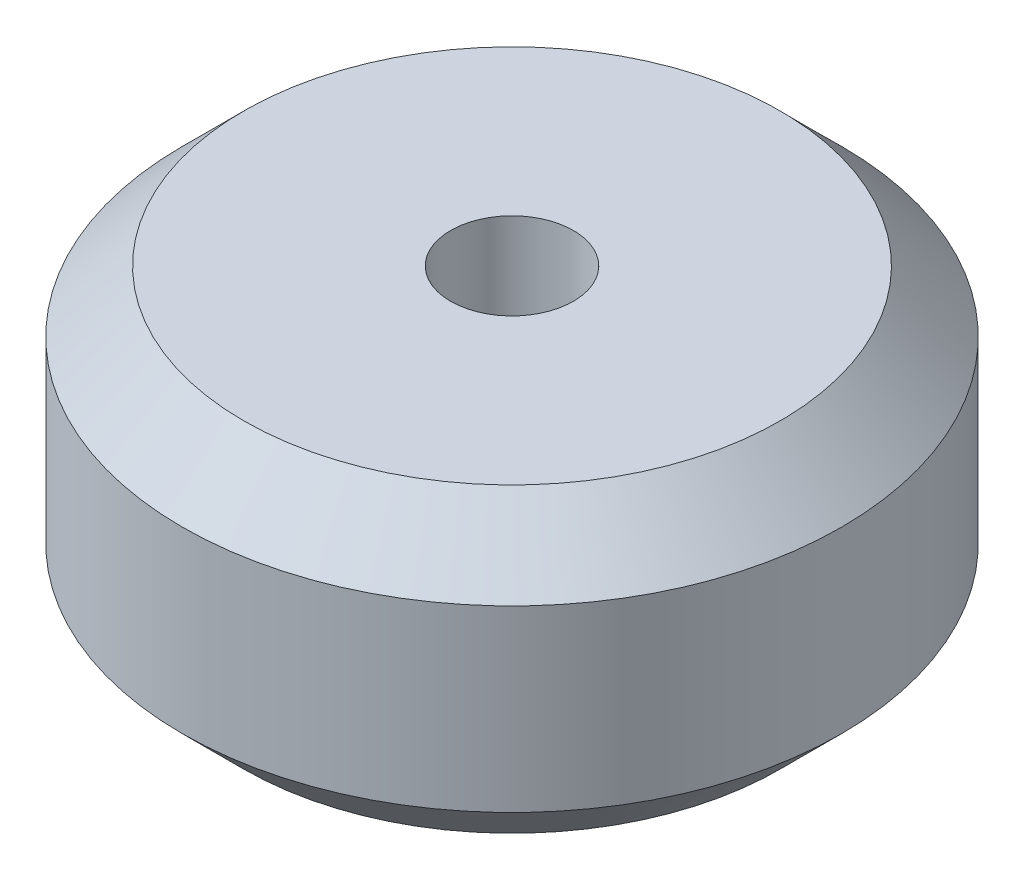
ISO-10303-21;
HEADER;
FILE_DESCRIPTION(('STEP AP214'),'2;1');
FILE_NAME('part.step','',(''),(''),'','','');
FILE_SCHEMA(('AUTOMOTIVE_DESIGN { 1 0 10303 214 1 1 1 1 }'));
ENDSEC;
DATA;
#1=APPLICATION_CONTEXT('core data for automotive mechanical design processes');
#2=APPLICATION_PROTOCOL_DEFINITION('international standard','automotive_design',2000,#1);
#3=PRODUCT_CONTEXT('',#1,'mechanical');
#4=PRODUCT('Part','Part','',(#3));
#5=PRODUCT_RELATED_PRODUCT_CATEGORY('part','',(#4));
#6=PRODUCT_DEFINITION_FORMATION('','',#4);
#7=PRODUCT_DEFINITION_CONTEXT('part definition',#1,'design');
#8=PRODUCT_DEFINITION('design','',#6,#7);
#9=PRODUCT_DEFINITION_SHAPE('','',#8);
#10=(LENGTH_UNIT() NAMED_UNIT(*) SI_UNIT(.MILLI.,.METRE.));
#11=(NAMED_UNIT(*) PLANE_ANGLE_UNIT() SI_UNIT($,.RADIAN.));
#12=(NAMED_UNIT(*) SI_UNIT($,.STERADIAN.) SOLID_ANGLE_UNIT());
#13=UNCERTAINTY_MEASURE_WITH_UNIT(LENGTH_MEASURE(1.E-05),#10,'distance_accuracy_value','');
#14=(GEOMETRIC_REPRESENTATION_CONTEXT(3) GLOBAL_UNCERTAINTY_ASSIGNED_CONTEXT((#13)) GLOBAL_UNIT_ASSIGNED_CONTEXT((#10,
#11,#12)) REPRESENTATION_CONTEXT('',''));
#15=CARTESIAN_POINT('',(0.,0.,0.));
#16=DIRECTION('',(0.,0.,1.));
#17=DIRECTION('',(1.,0.,0.));
#18=AXIS2_PLACEMENT_3D('',#15,#16,#17);
#19=CARTESIAN_POINT('',(0.,10.922,0.));
#20=DIRECTION('',(0.,1.,0.));
#21=DIRECTION('',(0.,0.,1.));
#22=AXIS2_PLACEMENT_3D('',#19,#20,#21);
#23=PLANE('',#22);
#24=CARTESIAN_POINT('',(0.,10.922,0.));
#25=DIRECTION('',(0.,1.,0.));
#26=DIRECTION('',(0.,0.,1.));
#27=AXIS2_PLACEMENT_3D('',#24,#25,#26);
#28=CIRCLE('',#27,9.7155);
#29=CARTESIAN_POINT('',(0.,10.922,9.7155));
#30=VERTEX_POINT('',#29);
#31=EDGE_CURVE('E10',#30,#30,#28,.T.);
#32=ORIENTED_EDGE('',*,*,#31,.T.);
#33=EDGE_LOOP('',(#32));
#34=FACE_BOUND('',#33,.T.);
#35=CARTESIAN_POINT('',(0.,10.922,0.));
#36=DIRECTION('',(0.,1.,0.));
#37=DIRECTION('',(0.,0.,1.));
#38=AXIS2_PLACEMENT_3D('',#35,#36,#37);
#39=CIRCLE('',#38,2.2225);
#40=CARTESIAN_POINT('',(0.,10.922,2.2225));
#41=VERTEX_POINT('',#40);
#42=EDGE_CURVE('E70',#41,#41,#39,.T.);
#43=ORIENTED_EDGE('',*,*,#42,.F.);
#44=EDGE_LOOP('',(#43));
#45=FACE_BOUND('',#44,.T.);
#46=ADVANCED_FACE('F45',(#34,#45),#23,.T.);
#47=CARTESIAN_POINT('',(0.,0.,0.));
#48=DIRECTION('',(0.,1.,0.));
#49=DIRECTION('',(0.,0.,1.));
#50=AXIS2_PLACEMENT_3D('',#47,#48,#49);
#51=PLANE('',#50);
#52=CARTESIAN_POINT('',(0.,0.,0.));
#53=DIRECTION('',(0.,1.,0.));
#54=DIRECTION('',(0.,0.,1.));
#55=AXIS2_PLACEMENT_3D('',#52,#53,#54);
#56=CIRCLE('',#55,9.71549999999998);
#57=CARTESIAN_POINT('',(0.,0.,9.71549999999998));
#58=VERTEX_POINT('',#57);
#59=EDGE_CURVE('E54',#58,#58,#56,.F.);
#60=ORIENTED_EDGE('',*,*,#59,.T.);
#61=EDGE_LOOP('',(#60));
#62=FACE_BOUND('',#61,.T.);
#63=CARTESIAN_POINT('',(0.,0.,0.));
#64=DIRECTION('',(0.,1.,0.));
#65=DIRECTION('',(0.,0.,1.));
#66=AXIS2_PLACEMENT_3D('',#63,#64,#65);
#67=CIRCLE('',#66,2.2225);
#68=CARTESIAN_POINT('',(0.,0.,2.2225));
#69=VERTEX_POINT('',#68);
#70=EDGE_CURVE('E71',#69,#69,#67,.T.);
#71=ORIENTED_EDGE('',*,*,#70,.T.);
#72=EDGE_LOOP('',(#71));
#73=FACE_BOUND('',#72,.T.);
#74=ADVANCED_FACE('F83',(#62,#73),#51,.F.);
#75=CARTESIAN_POINT('',(0.,10.922,0.));
#76=DIRECTION('',(0.,-1.,0.));
#77=DIRECTION('',(0.,0.,-1.));
#78=AXIS2_PLACEMENT_3D('',#75,#76,#77);
#79=CYLINDRICAL_SURFACE('',#78,11.938);
#80=CARTESIAN_POINT('',(0.,2.2225,0.));
#81=DIRECTION('',(0.,1.,0.));
#82=DIRECTION('',(0.,0.,1.));
#83=AXIS2_PLACEMENT_3D('',#80,#81,#82);
#84=CIRCLE('',#83,11.938);
#85=CARTESIAN_POINT('',(0.,2.2225,11.938));
#86=VERTEX_POINT('',#85);
#87=EDGE_CURVE('E59',#86,#86,#84,.T.);
#88=ORIENTED_EDGE('',*,*,#87,.T.);
#89=EDGE_LOOP('',(#88));
#90=FACE_BOUND('',#89,.T.);
#91=CARTESIAN_POINT('',(0.,8.69949999999999,0.));
#92=DIRECTION('',(0.,1.,0.));
#93=DIRECTION('',(0.,0.,1.));
#94=AXIS2_PLACEMENT_3D('',#91,#92,#93);
#95=CIRCLE('',#94,11.938);
#96=CARTESIAN_POINT('',(0.,8.69949999999999,11.938));
#97=VERTEX_POINT('',#96);
#98=EDGE_CURVE('E64',#97,#97,#95,.F.);
#99=ORIENTED_EDGE('',*,*,#98,.T.);
#100=EDGE_LOOP('',(#99));
#101=FACE_BOUND('',#100,.T.);
#102=ADVANCED_FACE('F89',(#90,#101),#79,.T.);
#103=CARTESIAN_POINT('',(0.,10.922,0.));
#104=DIRECTION('',(0.,-1.,0.));
#105=DIRECTION('',(0.,0.,-1.));
#106=AXIS2_PLACEMENT_3D('',#103,#104,#105);
#107=CYLINDRICAL_SURFACE('',#106,2.2225);
#108=ORIENTED_EDGE('',*,*,#42,.T.);
#109=EDGE_LOOP('',(#108));
#110=FACE_BOUND('',#109,.T.);
#111=ORIENTED_EDGE('',*,*,#70,.F.);
#112=EDGE_LOOP('',(#111));
#113=FACE_BOUND('',#112,.T.);
#114=ADVANCED_FACE('F79',(#110,#113),#107,.F.);
#115=CARTESIAN_POINT('',(0.,2.2225,0.));
#116=DIRECTION('',(0.,1.,0.));
#117=DIRECTION('',(0.,0.,1.));
#118=AXIS2_PLACEMENT_3D('',#115,#116,#117);
#119=CONICAL_SURFACE('',#118,11.938,0.785398163397451);
#120=ORIENTED_EDGE('',*,*,#59,.F.);
#121=EDGE_LOOP('',(#120));
#122=FACE_BOUND('',#121,.T.);
#123=ORIENTED_EDGE('',*,*,#87,.F.);
#124=EDGE_LOOP('',(#123));
#125=FACE_BOUND('',#124,.T.);
#126=ADVANCED_FACE('F96',(#122,#125),#119,.T.);
#127=CARTESIAN_POINT('',(0.,10.922,0.));
#128=DIRECTION('',(0.,-1.,0.));
#129=DIRECTION('',(0.,0.,-1.));
#130=AXIS2_PLACEMENT_3D('',#127,#128,#129);
#131=CONICAL_SURFACE('',#130,9.7155,0.785398163397447);
#132=ORIENTED_EDGE('',*,*,#98,.F.);
#133=EDGE_LOOP('',(#132));
#134=FACE_BOUND('',#133,.T.);
#135=ORIENTED_EDGE('',*,*,#31,.F.);
#136=EDGE_LOOP('',(#135));
#137=FACE_BOUND('',#136,.T.);
#138=ADVANCED_FACE('F48',(#134,#137),#131,.T.);
#139=CLOSED_SHELL('',(#46,#74,#102,#114,#126,#138));
#140=MANIFOLD_SOLID_BREP('B2',#139);
#141=ADVANCED_BREP_SHAPE_REPRESENTATION('',(#18,#140),#14);
#142=SHAPE_DEFINITION_REPRESENTATION(#9,#141);
ENDSEC;
END-ISO-10303-21;
